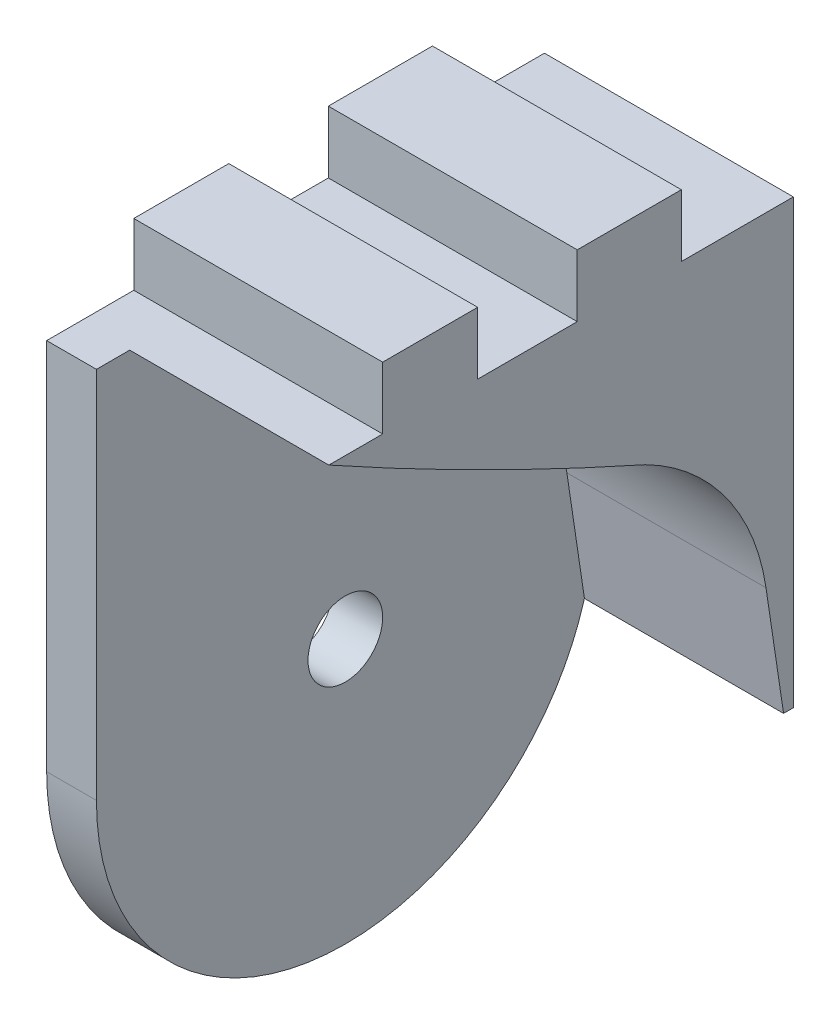
ISO-10303-21;
HEADER;
FILE_DESCRIPTION(('STEP AP214'),'2;1');
FILE_NAME('part.step','',(''),(''),'','','');
FILE_SCHEMA(('AUTOMOTIVE_DESIGN { 1 0 10303 214 1 1 1 1 }'));
ENDSEC;
DATA;
#1=APPLICATION_CONTEXT('core data for automotive mechanical design processes');
#2=APPLICATION_PROTOCOL_DEFINITION('international standard','automotive_design',2000,#1);
#3=PRODUCT_CONTEXT('',#1,'mechanical');
#4=PRODUCT('Part','Part','',(#3));
#5=PRODUCT_RELATED_PRODUCT_CATEGORY('part','',(#4));
#6=PRODUCT_DEFINITION_FORMATION('','',#4);
#7=PRODUCT_DEFINITION_CONTEXT('part definition',#1,'design');
#8=PRODUCT_DEFINITION('design','',#6,#7);
#9=PRODUCT_DEFINITION_SHAPE('','',#8);
#10=(LENGTH_UNIT() NAMED_UNIT(*) SI_UNIT(.MILLI.,.METRE.));
#11=(NAMED_UNIT(*) PLANE_ANGLE_UNIT() SI_UNIT($,.RADIAN.));
#12=(NAMED_UNIT(*) SI_UNIT($,.STERADIAN.) SOLID_ANGLE_UNIT());
#13=UNCERTAINTY_MEASURE_WITH_UNIT(LENGTH_MEASURE(1.E-05),#10,'distance_accuracy_value','');
#14=(GEOMETRIC_REPRESENTATION_CONTEXT(3) GLOBAL_UNCERTAINTY_ASSIGNED_CONTEXT((#13)) GLOBAL_UNIT_ASSIGNED_CONTEXT((#10,
#11,#12)) REPRESENTATION_CONTEXT('',''));
#15=CARTESIAN_POINT('',(0.,0.,0.));
#16=DIRECTION('',(0.,0.,1.));
#17=DIRECTION('',(1.,0.,0.));
#18=AXIS2_PLACEMENT_3D('',#15,#16,#17);
#19=CARTESIAN_POINT('',(-4.,55.,40.));
#20=DIRECTION('',(0.,-1.,0.));
#21=DIRECTION('',(1.,0.,0.));
#22=AXIS2_PLACEMENT_3D('',#19,#20,#21);
#23=PLANE('',#22);
#24=DIRECTION('',(0.,0.,-1.));
#25=VECTOR('',#24,1.);
#26=CARTESIAN_POINT('',(-4.,55.,40.));
#27=LINE('',#26,#25);
#28=CARTESIAN_POINT('',(-4.,55.,33.));
#29=VERTEX_POINT('',#28);
#30=CARTESIAN_POINT('',(-4.,55.,25.3660375931076));
#31=VERTEX_POINT('',#30);
#32=EDGE_CURVE('E282',#29,#31,#27,.T.);
#33=ORIENTED_EDGE('',*,*,#32,.F.);
#34=DIRECTION('',(-1.,0.,0.));
#35=VECTOR('',#34,1.);
#36=CARTESIAN_POINT('',(16.,55.,33.));
#37=LINE('',#36,#35);
#38=CARTESIAN_POINT('',(16.,55.,33.));
#39=VERTEX_POINT('',#38);
#40=EDGE_CURVE('E219',#39,#29,#37,.T.);
#41=ORIENTED_EDGE('',*,*,#40,.F.);
#42=DIRECTION('',(0.,0.,-1.));
#43=VECTOR('',#42,1.);
#44=CARTESIAN_POINT('',(16.,55.,40.));
#45=LINE('',#44,#43);
#46=CARTESIAN_POINT('',(16.,55.,25.3660375931076));
#47=VERTEX_POINT('',#46);
#48=EDGE_CURVE('E285',#39,#47,#45,.T.);
#49=ORIENTED_EDGE('',*,*,#48,.T.);
#50=DIRECTION('',(-1.,0.,0.));
#51=VECTOR('',#50,1.);
#52=CARTESIAN_POINT('',(16.,55.,25.3660375931076));
#53=LINE('',#52,#51);
#54=EDGE_CURVE('E221',#47,#31,#53,.T.);
#55=ORIENTED_EDGE('',*,*,#54,.T.);
#56=EDGE_LOOP('',(#33,#41,#49,#55));
#57=FACE_BOUND('',#56,.T.);
#58=ADVANCED_FACE('F38',(#57),#23,.F.);
#59=CARTESIAN_POINT('',(0.,0.,40.));
#60=DIRECTION('',(-1.,0.,0.));
#61=DIRECTION('',(0.,0.,1.));
#62=AXIS2_PLACEMENT_3D('',#59,#60,#61);
#63=PLANE('',#62);
#64=CARTESIAN_POINT('',(0.,21.2375980792143,20.));
#65=DIRECTION('',(-1.,0.,0.));
#66=DIRECTION('',(0.,0.,1.));
#67=AXIS2_PLACEMENT_3D('',#64,#65,#66);
#68=CIRCLE('',#67,3.);
#69=CARTESIAN_POINT('',(0.,21.2375980792143,23.));
#70=VERTEX_POINT('',#69);
#71=EDGE_CURVE('E236',#70,#70,#68,.T.);
#72=ORIENTED_EDGE('',*,*,#71,.T.);
#73=EDGE_LOOP('',(#72));
#74=FACE_BOUND('',#73,.T.);
#75=CARTESIAN_POINT('',(0.,335.816317486461,-121.193092553436));
#76=DIRECTION('',(-1.,0.,0.));
#77=DIRECTION('',(0.,0.,1.));
#78=AXIS2_PLACEMENT_3D('',#75,#76,#77);
#79=CIRCLE('',#78,326.831732663771);
#80=CARTESIAN_POINT('',(0.,50.,37.3250897931997));
#81=VERTEX_POINT('',#80);
#82=CARTESIAN_POINT('',(0.,37.3056268301771,11.8871427931811));
#83=VERTEX_POINT('',#82);
#84=EDGE_CURVE('E266',#81,#83,#79,.F.);
#85=ORIENTED_EDGE('',*,*,#84,.F.);
#86=DIRECTION('',(0.,0.,1.));
#87=VECTOR('',#86,1.);
#88=CARTESIAN_POINT('',(0.,50.,40.0000000000001));
#89=LINE('',#88,#87);
#90=CARTESIAN_POINT('',(0.,50.,40.));
#91=VERTEX_POINT('',#90);
#92=EDGE_CURVE('E216',#81,#91,#89,.T.);
#93=ORIENTED_EDGE('',*,*,#92,.T.);
#94=DIRECTION('',(0.,1.,0.));
#95=VECTOR('',#94,1.);
#96=CARTESIAN_POINT('',(0.,0.,40.));
#97=LINE('',#96,#95);
#98=CARTESIAN_POINT('',(0.,20.,40.));
#99=VERTEX_POINT('',#98);
#100=EDGE_CURVE('E271',#99,#91,#97,.T.);
#101=ORIENTED_EDGE('',*,*,#100,.F.);
#102=CARTESIAN_POINT('',(0.,20.,20.));
#103=DIRECTION('',(-1.,0.,0.));
#104=DIRECTION('',(0.,0.,1.));
#105=AXIS2_PLACEMENT_3D('',#102,#103,#104);
#106=CIRCLE('',#105,20.);
#107=CARTESIAN_POINT('',(0.,0.,20.));
#108=VERTEX_POINT('',#107);
#109=EDGE_CURVE('E286',#99,#108,#106,.F.);
#110=ORIENTED_EDGE('',*,*,#109,.T.);
#111=CARTESIAN_POINT('',(0.,20.,20.));
#112=DIRECTION('',(-1.,0.,0.));
#113=DIRECTION('',(0.,0.,1.));
#114=AXIS2_PLACEMENT_3D('',#111,#112,#113);
#115=CIRCLE('',#114,20.);
#116=CARTESIAN_POINT('',(0.,14.4473036085163,0.786266297671242));
#117=VERTEX_POINT('',#116);
#118=EDGE_CURVE('E288',#108,#117,#115,.F.);
#119=ORIENTED_EDGE('',*,*,#118,.T.);
#120=DIRECTION('',(0.,0.989031049423699,0.147707763085953));
#121=VECTOR('',#120,1.);
#122=CARTESIAN_POINT('',(0.,6.04384407887813,-0.468756191288486));
#123=LINE('',#122,#121);
#124=CARTESIAN_POINT('',(0.,23.8963378147614,2.19744111037341));
#125=VERTEX_POINT('',#124);
#126=EDGE_CURVE('E255',#117,#125,#123,.T.);
#127=ORIENTED_EDGE('',*,*,#126,.T.);
#128=CARTESIAN_POINT('',(0.,21.2375980792143,20.));
#129=DIRECTION('',(-1.,0.,0.));
#130=DIRECTION('',(0.,0.,1.));
#131=AXIS2_PLACEMENT_3D('',#128,#129,#130);
#132=CIRCLE('',#131,18.);
#133=EDGE_CURVE('E268',#83,#125,#132,.T.);
#134=ORIENTED_EDGE('',*,*,#133,.F.);
#135=EDGE_LOOP('',(#85,#93,#101,#110,#119,#127,#134));
#136=FACE_BOUND('',#135,.T.);
#137=ADVANCED_FACE('F322',(#74,#136),#63,.F.);
#138=CARTESIAN_POINT('',(16.,55.,40.));
#139=DIRECTION('',(-1.,0.,0.));
#140=DIRECTION('',(0.,0.,1.));
#141=AXIS2_PLACEMENT_3D('',#138,#139,#140);
#142=PLANE('',#141);
#143=DIRECTION('',(0.,-1.,0.));
#144=VECTOR('',#143,1.);
#145=CARTESIAN_POINT('',(16.,55.,33.));
#146=LINE('',#145,#144);
#147=CARTESIAN_POINT('',(16.,50.,33.));
#148=VERTEX_POINT('',#147);
#149=EDGE_CURVE('E196',#39,#148,#146,.T.);
#150=ORIENTED_EDGE('',*,*,#149,.T.);
#151=DIRECTION('',(0.,0.,1.));
#152=VECTOR('',#151,1.);
#153=CARTESIAN_POINT('',(16.,50.,33.));
#154=LINE('',#153,#152);
#155=CARTESIAN_POINT('',(16.,50.0000000000002,37.3250897931997));
#156=VERTEX_POINT('',#155);
#157=EDGE_CURVE('E198',#148,#156,#154,.T.);
#158=ORIENTED_EDGE('',*,*,#157,.T.);
#159=CARTESIAN_POINT('',(16.,335.816317486461,-121.193092553436));
#160=DIRECTION('',(-1.,0.,0.));
#161=DIRECTION('',(0.,0.,1.));
#162=AXIS2_PLACEMENT_3D('',#159,#160,#161);
#163=CIRCLE('',#162,326.831732663771);
#164=CARTESIAN_POINT('',(16.,37.3056268301771,11.8871427931811));
#165=VERTEX_POINT('',#164);
#166=EDGE_CURVE('E248',#156,#165,#163,.F.);
#167=ORIENTED_EDGE('',*,*,#166,.T.);
#168=CARTESIAN_POINT('',(16.,21.2375980792143,20.));
#169=DIRECTION('',(-1.,0.,0.));
#170=DIRECTION('',(0.,0.,1.));
#171=AXIS2_PLACEMENT_3D('',#168,#169,#170);
#172=CIRCLE('',#171,18.);
#173=CARTESIAN_POINT('',(16.,23.8963378147614,2.19744111037341));
#174=VERTEX_POINT('',#173);
#175=EDGE_CURVE('E246',#165,#174,#172,.T.);
#176=ORIENTED_EDGE('',*,*,#175,.T.);
#177=DIRECTION('',(0.,0.989031049423699,0.147707763085953));
#178=VECTOR('',#177,1.);
#179=CARTESIAN_POINT('',(16.,0.200341521561027,-1.34145952232274));
#180=LINE('',#179,#178);
#181=CARTESIAN_POINT('',(16.,14.4473036085163,0.786266297671242));
#182=VERTEX_POINT('',#181);
#183=EDGE_CURVE('E243',#182,#174,#180,.T.);
#184=ORIENTED_EDGE('',*,*,#183,.F.);
#185=DIRECTION('',(0.,0.,1.));
#186=VECTOR('',#185,1.);
#187=CARTESIAN_POINT('',(16.,14.4473036085163,0.));
#188=LINE('',#187,#186);
#189=CARTESIAN_POINT('',(16.,14.4473036085163,0.));
#190=VERTEX_POINT('',#189);
#191=EDGE_CURVE('E240',#190,#182,#188,.T.);
#192=ORIENTED_EDGE('',*,*,#191,.F.);
#193=DIRECTION('',(0.,1.,0.));
#194=VECTOR('',#193,1.);
#195=CARTESIAN_POINT('',(16.,55.,0.));
#196=LINE('',#195,#194);
#197=CARTESIAN_POINT('',(16.,50.,0.));
#198=VERTEX_POINT('',#197);
#199=EDGE_CURVE('E182',#190,#198,#196,.T.);
#200=ORIENTED_EDGE('',*,*,#199,.T.);
#201=DIRECTION('',(0.,0.,1.));
#202=VECTOR('',#201,1.);
#203=CARTESIAN_POINT('',(16.,50.,0.));
#204=LINE('',#203,#202);
#205=CARTESIAN_POINT('',(16.,50.,9.00000000000001));
#206=VERTEX_POINT('',#205);
#207=EDGE_CURVE('E61',#198,#206,#204,.T.);
#208=ORIENTED_EDGE('',*,*,#207,.T.);
#209=DIRECTION('',(0.,1.,0.));
#210=VECTOR('',#209,1.);
#211=CARTESIAN_POINT('',(16.,50.,9.00000000000001));
#212=LINE('',#211,#210);
#213=CARTESIAN_POINT('',(16.,55.,9.));
#214=VERTEX_POINT('',#213);
#215=EDGE_CURVE('E170',#206,#214,#212,.T.);
#216=ORIENTED_EDGE('',*,*,#215,.T.);
#217=CARTESIAN_POINT('',(16.,55.,17.3660375931076));
#218=VERTEX_POINT('',#217);
#219=EDGE_CURVE('E283',#218,#214,#45,.T.);
#220=ORIENTED_EDGE('',*,*,#219,.F.);
#221=DIRECTION('',(0.,-1.,0.));
#222=VECTOR('',#221,1.);
#223=CARTESIAN_POINT('',(16.,55.,17.3660375931076));
#224=LINE('',#223,#222);
#225=CARTESIAN_POINT('',(16.,50.,17.3660375931076));
#226=VERTEX_POINT('',#225);
#227=EDGE_CURVE('E176',#218,#226,#224,.T.);
#228=ORIENTED_EDGE('',*,*,#227,.T.);
#229=DIRECTION('',(0.,0.,1.));
#230=VECTOR('',#229,1.);
#231=CARTESIAN_POINT('',(16.,50.,17.3660375931076));
#232=LINE('',#231,#230);
#233=CARTESIAN_POINT('',(16.,50.,25.3660375931076));
#234=VERTEX_POINT('',#233);
#235=EDGE_CURVE('E190',#226,#234,#232,.T.);
#236=ORIENTED_EDGE('',*,*,#235,.T.);
#237=DIRECTION('',(0.,1.,0.));
#238=VECTOR('',#237,1.);
#239=CARTESIAN_POINT('',(16.,50.,25.3660375931076));
#240=LINE('',#239,#238);
#241=EDGE_CURVE('E193',#234,#47,#240,.T.);
#242=ORIENTED_EDGE('',*,*,#241,.T.);
#243=ORIENTED_EDGE('',*,*,#48,.F.);
#244=EDGE_LOOP('',(#150,#158,#167,#176,#184,#192,#200,#208,#216,#220,#228,#236,#242,#243));
#245=FACE_BOUND('',#244,.T.);
#246=ADVANCED_FACE('F180',(#245),#142,.F.);
#247=CARTESIAN_POINT('',(-4.,55.,17.3660375931076));
#248=VERTEX_POINT('',#247);
#249=CARTESIAN_POINT('',(-4.,55.,9.));
#250=VERTEX_POINT('',#249);
#251=EDGE_CURVE('E277',#248,#250,#27,.T.);
#252=ORIENTED_EDGE('',*,*,#251,.F.);
#253=DIRECTION('',(-1.,0.,0.));
#254=VECTOR('',#253,1.);
#255=CARTESIAN_POINT('',(16.,55.,17.3660375931076));
#256=LINE('',#255,#254);
#257=EDGE_CURVE('E53',#218,#248,#256,.T.);
#258=ORIENTED_EDGE('',*,*,#257,.F.);
#259=ORIENTED_EDGE('',*,*,#219,.T.);
#260=DIRECTION('',(-1.,0.,0.));
#261=VECTOR('',#260,1.);
#262=CARTESIAN_POINT('',(16.,55.,9.));
#263=LINE('',#262,#261);
#264=EDGE_CURVE('E166',#214,#250,#263,.T.);
#265=ORIENTED_EDGE('',*,*,#264,.T.);
#266=EDGE_LOOP('',(#252,#258,#259,#265));
#267=FACE_BOUND('',#266,.T.);
#268=ADVANCED_FACE('F354',(#267),#23,.F.);
#269=CARTESIAN_POINT('',(-4.,0.,40.));
#270=DIRECTION('',(1.,0.,0.));
#271=DIRECTION('',(0.,0.,-1.));
#272=AXIS2_PLACEMENT_3D('',#269,#270,#271);
#273=PLANE('',#272);
#274=CARTESIAN_POINT('',(-4.,21.2375980792143,20.));
#275=DIRECTION('',(-1.,0.,0.));
#276=DIRECTION('',(0.,0.,1.));
#277=AXIS2_PLACEMENT_3D('',#274,#275,#276);
#278=CIRCLE('',#277,3.);
#279=CARTESIAN_POINT('',(-4.,21.2375980792143,23.));
#280=VERTEX_POINT('',#279);
#281=EDGE_CURVE('E233',#280,#280,#278,.T.);
#282=ORIENTED_EDGE('',*,*,#281,.F.);
#283=EDGE_LOOP('',(#282));
#284=FACE_BOUND('',#283,.T.);
#285=DIRECTION('',(0.,-1.,0.));
#286=VECTOR('',#285,1.);
#287=CARTESIAN_POINT('',(-4.,0.,40.));
#288=LINE('',#287,#286);
#289=CARTESIAN_POINT('',(-4.,50.,40.));
#290=VERTEX_POINT('',#289);
#291=CARTESIAN_POINT('',(-4.,20.,40.));
#292=VERTEX_POINT('',#291);
#293=EDGE_CURVE('E274',#290,#292,#288,.T.);
#294=ORIENTED_EDGE('',*,*,#293,.F.);
#295=DIRECTION('',(0.,0.,1.));
#296=VECTOR('',#295,1.);
#297=CARTESIAN_POINT('',(-4.,50.,33.));
#298=LINE('',#297,#296);
#299=CARTESIAN_POINT('',(-4.,50.,33.));
#300=VERTEX_POINT('',#299);
#301=EDGE_CURVE('E183',#300,#290,#298,.T.);
#302=ORIENTED_EDGE('',*,*,#301,.F.);
#303=DIRECTION('',(0.,-1.,0.));
#304=VECTOR('',#303,1.);
#305=CARTESIAN_POINT('',(-4.,55.,33.));
#306=LINE('',#305,#304);
#307=EDGE_CURVE('E185',#29,#300,#306,.T.);
#308=ORIENTED_EDGE('',*,*,#307,.F.);
#309=ORIENTED_EDGE('',*,*,#32,.T.);
#310=DIRECTION('',(0.,1.,0.));
#311=VECTOR('',#310,1.);
#312=CARTESIAN_POINT('',(-4.,50.,25.3660375931076));
#313=LINE('',#312,#311);
#314=CARTESIAN_POINT('',(-4.,50.,25.3660375931076));
#315=VERTEX_POINT('',#314);
#316=EDGE_CURVE('E209',#315,#31,#313,.T.);
#317=ORIENTED_EDGE('',*,*,#316,.F.);
#318=DIRECTION('',(0.,0.,1.));
#319=VECTOR('',#318,1.);
#320=CARTESIAN_POINT('',(-4.,50.,17.3660375931076));
#321=LINE('',#320,#319);
#322=CARTESIAN_POINT('',(-4.,50.,17.3660375931076));
#323=VERTEX_POINT('',#322);
#324=EDGE_CURVE('E206',#323,#315,#321,.T.);
#325=ORIENTED_EDGE('',*,*,#324,.F.);
#326=DIRECTION('',(0.,-1.,0.));
#327=VECTOR('',#326,1.);
#328=CARTESIAN_POINT('',(-4.,55.,17.3660375931076));
#329=LINE('',#328,#327);
#330=EDGE_CURVE('E204',#248,#323,#329,.T.);
#331=ORIENTED_EDGE('',*,*,#330,.F.);
#332=ORIENTED_EDGE('',*,*,#251,.T.);
#333=DIRECTION('',(0.,1.,0.));
#334=VECTOR('',#333,1.);
#335=CARTESIAN_POINT('',(-4.,50.,9.00000000000001));
#336=LINE('',#335,#334);
#337=CARTESIAN_POINT('',(-4.,50.,9.00000000000001));
#338=VERTEX_POINT('',#337);
#339=EDGE_CURVE('E202',#338,#250,#336,.T.);
#340=ORIENTED_EDGE('',*,*,#339,.F.);
#341=DIRECTION('',(0.,0.,1.));
#342=VECTOR('',#341,1.);
#343=CARTESIAN_POINT('',(-4.,50.,0.));
#344=LINE('',#343,#342);
#345=CARTESIAN_POINT('',(-4.,50.,0.));
#346=VERTEX_POINT('',#345);
#347=EDGE_CURVE('E163',#346,#338,#344,.T.);
#348=ORIENTED_EDGE('',*,*,#347,.F.);
#349=DIRECTION('',(0.,-1.,0.));
#350=VECTOR('',#349,1.);
#351=CARTESIAN_POINT('',(-4.,0.,0.));
#352=LINE('',#351,#350);
#353=CARTESIAN_POINT('',(-4.,14.4473036085163,0.));
#354=VERTEX_POINT('',#353);
#355=EDGE_CURVE('E275',#346,#354,#352,.T.);
#356=ORIENTED_EDGE('',*,*,#355,.T.);
#357=DIRECTION('',(0.,0.,1.));
#358=VECTOR('',#357,1.);
#359=CARTESIAN_POINT('',(-4.,14.4473036085163,0.));
#360=LINE('',#359,#358);
#361=CARTESIAN_POINT('',(-4.,14.4473036085163,0.786266297671243));
#362=VERTEX_POINT('',#361);
#363=EDGE_CURVE('E239',#354,#362,#360,.T.);
#364=ORIENTED_EDGE('',*,*,#363,.T.);
#365=CARTESIAN_POINT('',(-4.,20.,20.));
#366=DIRECTION('',(1.,0.,0.));
#367=DIRECTION('',(0.,0.,-1.));
#368=AXIS2_PLACEMENT_3D('',#365,#366,#367);
#369=CIRCLE('',#368,20.);
#370=CARTESIAN_POINT('',(-4.,0.,20.));
#371=VERTEX_POINT('',#370);
#372=EDGE_CURVE('E294',#362,#371,#369,.F.);
#373=ORIENTED_EDGE('',*,*,#372,.T.);
#374=CARTESIAN_POINT('',(-4.,20.,20.));
#375=DIRECTION('',(1.,0.,0.));
#376=DIRECTION('',(0.,0.,-1.));
#377=AXIS2_PLACEMENT_3D('',#374,#375,#376);
#378=CIRCLE('',#377,20.);
#379=EDGE_CURVE('E291',#371,#292,#378,.F.);
#380=ORIENTED_EDGE('',*,*,#379,.T.);
#381=EDGE_LOOP('',(#294,#302,#308,#309,#317,#325,#331,#332,#340,#348,#356,#364,#373,#380));
#382=FACE_BOUND('',#381,.T.);
#383=ADVANCED_FACE('F313',(#284,#382),#273,.F.);
#384=CARTESIAN_POINT('',(0.,0.,40.));
#385=DIRECTION('',(0.,0.,-1.));
#386=DIRECTION('',(-1.,0.,0.));
#387=AXIS2_PLACEMENT_3D('',#384,#385,#386);
#388=PLANE('',#387);
#389=ORIENTED_EDGE('',*,*,#100,.T.);
#390=DIRECTION('',(-1.,0.,0.));
#391=VECTOR('',#390,1.);
#392=CARTESIAN_POINT('',(16.,50.,40.));
#393=LINE('',#392,#391);
#394=EDGE_CURVE('E213',#91,#290,#393,.T.);
#395=ORIENTED_EDGE('',*,*,#394,.T.);
#396=ORIENTED_EDGE('',*,*,#293,.T.);
#397=DIRECTION('',(1.,0.,0.));
#398=VECTOR('',#397,1.);
#399=CARTESIAN_POINT('',(0.,20.,40.));
#400=LINE('',#399,#398);
#401=EDGE_CURVE('E296',#292,#99,#400,.T.);
#402=ORIENTED_EDGE('',*,*,#401,.T.);
#403=EDGE_LOOP('',(#389,#395,#396,#402));
#404=FACE_BOUND('',#403,.T.);
#405=ADVANCED_FACE('F319',(#404),#388,.F.);
#406=CARTESIAN_POINT('',(0.,0.,0.));
#407=DIRECTION('',(0.,0.,-1.));
#408=DIRECTION('',(-1.,0.,0.));
#409=AXIS2_PLACEMENT_3D('',#406,#407,#408);
#410=PLANE('',#409);
#411=DIRECTION('',(-1.,0.,0.));
#412=VECTOR('',#411,1.);
#413=CARTESIAN_POINT('',(16.,50.,0.));
#414=LINE('',#413,#412);
#415=EDGE_CURVE('E167',#198,#346,#414,.T.);
#416=ORIENTED_EDGE('',*,*,#415,.F.);
#417=ORIENTED_EDGE('',*,*,#199,.F.);
#418=DIRECTION('',(-1.,0.,0.));
#419=VECTOR('',#418,1.);
#420=CARTESIAN_POINT('',(16.,14.4473036085163,0.));
#421=LINE('',#420,#419);
#422=EDGE_CURVE('E250',#190,#354,#421,.T.);
#423=ORIENTED_EDGE('',*,*,#422,.T.);
#424=ORIENTED_EDGE('',*,*,#355,.F.);
#425=EDGE_LOOP('',(#416,#417,#423,#424));
#426=FACE_BOUND('',#425,.T.);
#427=ADVANCED_FACE('F380',(#426),#410,.T.);
#428=CARTESIAN_POINT('',(0.,20.,20.));
#429=DIRECTION('',(1.,0.,0.));
#430=DIRECTION('',(0.,1.,0.));
#431=AXIS2_PLACEMENT_3D('',#428,#429,#430);
#432=CYLINDRICAL_SURFACE('',#431,20.);
#433=ORIENTED_EDGE('',*,*,#401,.F.);
#434=ORIENTED_EDGE('',*,*,#379,.F.);
#435=DIRECTION('',(1.,0.,0.));
#436=VECTOR('',#435,1.);
#437=CARTESIAN_POINT('',(0.,0.,20.));
#438=LINE('',#437,#436);
#439=EDGE_CURVE('E270',#108,#371,#438,.F.);
#440=ORIENTED_EDGE('',*,*,#439,.F.);
#441=ORIENTED_EDGE('',*,*,#109,.F.);
#442=EDGE_LOOP('',(#433,#434,#440,#441));
#443=FACE_BOUND('',#442,.T.);
#444=ADVANCED_FACE('F40',(#443),#432,.T.);
#445=CARTESIAN_POINT('',(0.,20.,20.));
#446=DIRECTION('',(-1.,0.,0.));
#447=DIRECTION('',(0.,-1.,0.));
#448=AXIS2_PLACEMENT_3D('',#445,#446,#447);
#449=CYLINDRICAL_SURFACE('',#448,20.);
#450=DIRECTION('',(-1.,0.,0.));
#451=VECTOR('',#450,1.);
#452=CARTESIAN_POINT('',(0.,14.4473036085163,0.786266297671246));
#453=LINE('',#452,#451);
#454=EDGE_CURVE('E46',#117,#362,#453,.T.);
#455=ORIENTED_EDGE('',*,*,#454,.F.);
#456=ORIENTED_EDGE('',*,*,#118,.F.);
#457=ORIENTED_EDGE('',*,*,#439,.T.);
#458=ORIENTED_EDGE('',*,*,#372,.F.);
#459=EDGE_LOOP('',(#455,#456,#457,#458));
#460=FACE_BOUND('',#459,.T.);
#461=ADVANCED_FACE('F308',(#460),#449,.T.);
#462=CARTESIAN_POINT('',(16.,21.2375980792143,20.));
#463=DIRECTION('',(-1.,0.,0.));
#464=DIRECTION('',(0.,0.,1.));
#465=AXIS2_PLACEMENT_3D('',#462,#463,#464);
#466=CYLINDRICAL_SURFACE('',#465,18.);
#467=DIRECTION('',(-1.,0.,0.));
#468=VECTOR('',#467,1.);
#469=CARTESIAN_POINT('',(16.,37.3056268301771,11.8871427931811));
#470=LINE('',#469,#468);
#471=EDGE_CURVE('E252',#165,#83,#470,.T.);
#472=ORIENTED_EDGE('',*,*,#471,.T.);
#473=ORIENTED_EDGE('',*,*,#133,.T.);
#474=DIRECTION('',(-1.,0.,0.));
#475=VECTOR('',#474,1.);
#476=CARTESIAN_POINT('',(16.,23.8963378147614,2.19744111037341));
#477=LINE('',#476,#475);
#478=EDGE_CURVE('E256',#174,#125,#477,.T.);
#479=ORIENTED_EDGE('',*,*,#478,.F.);
#480=ORIENTED_EDGE('',*,*,#175,.F.);
#481=EDGE_LOOP('',(#472,#473,#479,#480));
#482=FACE_BOUND('',#481,.T.);
#483=ADVANCED_FACE('F373',(#482),#466,.F.);
#484=CARTESIAN_POINT('',(16.,335.816317486461,-121.193092553436));
#485=DIRECTION('',(-1.,0.,0.));
#486=DIRECTION('',(0.,0.,1.));
#487=AXIS2_PLACEMENT_3D('',#484,#485,#486);
#488=CYLINDRICAL_SURFACE('',#487,326.831732663771);
#489=ORIENTED_EDGE('',*,*,#166,.F.);
#490=DIRECTION('',(-1.,0.,0.));
#491=VECTOR('',#490,1.);
#492=CARTESIAN_POINT('',(16.,50.0000000000001,37.3250897931997));
#493=LINE('',#492,#491);
#494=EDGE_CURVE('E11',#156,#81,#493,.T.);
#495=ORIENTED_EDGE('',*,*,#494,.T.);
#496=ORIENTED_EDGE('',*,*,#84,.T.);
#497=ORIENTED_EDGE('',*,*,#471,.F.);
#498=EDGE_LOOP('',(#489,#495,#496,#497));
#499=FACE_BOUND('',#498,.T.);
#500=ADVANCED_FACE('F329',(#499),#488,.T.);
#501=CARTESIAN_POINT('',(16.,0.200341521561027,-1.34145952232274));
#502=DIRECTION('',(0.,-0.147707763085953,0.989031049423699));
#503=DIRECTION('',(0.,-0.989031049423699,-0.147707763085953));
#504=AXIS2_PLACEMENT_3D('',#501,#502,#503);
#505=PLANE('',#504);
#506=ORIENTED_EDGE('',*,*,#126,.F.);
#507=DIRECTION('',(-1.,0.,0.));
#508=VECTOR('',#507,1.);
#509=CARTESIAN_POINT('',(16.,14.4473036085163,0.786266297671242));
#510=LINE('',#509,#508);
#511=EDGE_CURVE('E259',#182,#117,#510,.T.);
#512=ORIENTED_EDGE('',*,*,#511,.F.);
#513=ORIENTED_EDGE('',*,*,#183,.T.);
#514=ORIENTED_EDGE('',*,*,#478,.T.);
#515=EDGE_LOOP('',(#506,#512,#513,#514));
#516=FACE_BOUND('',#515,.T.);
#517=ADVANCED_FACE('F394',(#516),#505,.T.);
#518=CARTESIAN_POINT('',(16.,14.4473036085163,0.));
#519=DIRECTION('',(0.,-1.,0.));
#520=DIRECTION('',(0.,0.,-1.));
#521=AXIS2_PLACEMENT_3D('',#518,#519,#520);
#522=PLANE('',#521);
#523=ORIENTED_EDGE('',*,*,#363,.F.);
#524=ORIENTED_EDGE('',*,*,#422,.F.);
#525=ORIENTED_EDGE('',*,*,#191,.T.);
#526=ORIENTED_EDGE('',*,*,#511,.T.);
#527=ORIENTED_EDGE('',*,*,#454,.T.);
#528=EDGE_LOOP('',(#523,#524,#525,#526,#527));
#529=FACE_BOUND('',#528,.T.);
#530=ADVANCED_FACE('F304',(#529),#522,.T.);
#531=CARTESIAN_POINT('',(6.,21.2375980792143,20.));
#532=DIRECTION('',(-1.,0.,0.));
#533=DIRECTION('',(0.,0.,1.));
#534=AXIS2_PLACEMENT_3D('',#531,#532,#533);
#535=CYLINDRICAL_SURFACE('',#534,3.);
#536=ORIENTED_EDGE('',*,*,#281,.T.);
#537=EDGE_LOOP('',(#536));
#538=FACE_BOUND('',#537,.T.);
#539=ORIENTED_EDGE('',*,*,#71,.F.);
#540=EDGE_LOOP('',(#539));
#541=FACE_BOUND('',#540,.T.);
#542=ADVANCED_FACE('F393',(#538,#541),#535,.F.);
#543=CARTESIAN_POINT('',(16.,50.,33.));
#544=DIRECTION('',(0.,-1.,0.));
#545=DIRECTION('',(0.,0.,-1.));
#546=AXIS2_PLACEMENT_3D('',#543,#544,#545);
#547=PLANE('',#546);
#548=ORIENTED_EDGE('',*,*,#494,.F.);
#549=ORIENTED_EDGE('',*,*,#157,.F.);
#550=DIRECTION('',(-1.,0.,0.));
#551=VECTOR('',#550,1.);
#552=CARTESIAN_POINT('',(16.,50.,33.));
#553=LINE('',#552,#551);
#554=EDGE_CURVE('E217',#148,#300,#553,.T.);
#555=ORIENTED_EDGE('',*,*,#554,.T.);
#556=ORIENTED_EDGE('',*,*,#301,.T.);
#557=ORIENTED_EDGE('',*,*,#394,.F.);
#558=ORIENTED_EDGE('',*,*,#92,.F.);
#559=EDGE_LOOP('',(#548,#549,#555,#556,#557,#558));
#560=FACE_BOUND('',#559,.T.);
#561=ADVANCED_FACE('F325',(#560),#547,.F.);
#562=CARTESIAN_POINT('',(16.,55.,33.));
#563=DIRECTION('',(0.,0.,-1.));
#564=DIRECTION('',(-1.,0.,0.));
#565=AXIS2_PLACEMENT_3D('',#562,#563,#564);
#566=PLANE('',#565);
#567=ORIENTED_EDGE('',*,*,#307,.T.);
#568=ORIENTED_EDGE('',*,*,#554,.F.);
#569=ORIENTED_EDGE('',*,*,#149,.F.);
#570=ORIENTED_EDGE('',*,*,#40,.T.);
#571=EDGE_LOOP('',(#567,#568,#569,#570));
#572=FACE_BOUND('',#571,.T.);
#573=ADVANCED_FACE('F338',(#572),#566,.F.);
#574=CARTESIAN_POINT('',(16.,50.,0.));
#575=DIRECTION('',(0.,-1.,0.));
#576=DIRECTION('',(0.,0.,-1.));
#577=AXIS2_PLACEMENT_3D('',#574,#575,#576);
#578=PLANE('',#577);
#579=ORIENTED_EDGE('',*,*,#347,.T.);
#580=DIRECTION('',(-1.,0.,0.));
#581=VECTOR('',#580,1.);
#582=CARTESIAN_POINT('',(16.,50.,9.00000000000001));
#583=LINE('',#582,#581);
#584=EDGE_CURVE('E159',#206,#338,#583,.T.);
#585=ORIENTED_EDGE('',*,*,#584,.F.);
#586=ORIENTED_EDGE('',*,*,#207,.F.);
#587=ORIENTED_EDGE('',*,*,#415,.T.);
#588=EDGE_LOOP('',(#579,#585,#586,#587));
#589=FACE_BOUND('',#588,.T.);
#590=ADVANCED_FACE('F161',(#589),#578,.F.);
#591=CARTESIAN_POINT('',(16.,50.,9.00000000000001));
#592=DIRECTION('',(0.,0.,1.));
#593=DIRECTION('',(0.,-1.,0.));
#594=AXIS2_PLACEMENT_3D('',#591,#592,#593);
#595=PLANE('',#594);
#596=ORIENTED_EDGE('',*,*,#339,.T.);
#597=ORIENTED_EDGE('',*,*,#264,.F.);
#598=ORIENTED_EDGE('',*,*,#215,.F.);
#599=ORIENTED_EDGE('',*,*,#584,.T.);
#600=EDGE_LOOP('',(#596,#597,#598,#599));
#601=FACE_BOUND('',#600,.T.);
#602=ADVANCED_FACE('F171',(#601),#595,.F.);
#603=CARTESIAN_POINT('',(16.,50.,25.3660375931076));
#604=DIRECTION('',(0.,0.,1.));
#605=DIRECTION('',(1.,0.,0.));
#606=AXIS2_PLACEMENT_3D('',#603,#604,#605);
#607=PLANE('',#606);
#608=ORIENTED_EDGE('',*,*,#316,.T.);
#609=ORIENTED_EDGE('',*,*,#54,.F.);
#610=ORIENTED_EDGE('',*,*,#241,.F.);
#611=DIRECTION('',(-1.,0.,0.));
#612=VECTOR('',#611,1.);
#613=CARTESIAN_POINT('',(16.,50.,25.3660375931076));
#614=LINE('',#613,#612);
#615=EDGE_CURVE('E224',#234,#315,#614,.T.);
#616=ORIENTED_EDGE('',*,*,#615,.T.);
#617=EDGE_LOOP('',(#608,#609,#610,#616));
#618=FACE_BOUND('',#617,.T.);
#619=ADVANCED_FACE('F347',(#618),#607,.F.);
#620=CARTESIAN_POINT('',(16.,50.,17.3660375931076));
#621=DIRECTION('',(0.,-1.,0.));
#622=DIRECTION('',(0.,0.,-1.));
#623=AXIS2_PLACEMENT_3D('',#620,#621,#622);
#624=PLANE('',#623);
#625=ORIENTED_EDGE('',*,*,#324,.T.);
#626=ORIENTED_EDGE('',*,*,#615,.F.);
#627=ORIENTED_EDGE('',*,*,#235,.F.);
#628=DIRECTION('',(-1.,0.,0.));
#629=VECTOR('',#628,1.);
#630=CARTESIAN_POINT('',(16.,50.,17.3660375931076));
#631=LINE('',#630,#629);
#632=EDGE_CURVE('E226',#226,#323,#631,.T.);
#633=ORIENTED_EDGE('',*,*,#632,.T.);
#634=EDGE_LOOP('',(#625,#626,#627,#633));
#635=FACE_BOUND('',#634,.T.);
#636=ADVANCED_FACE('F350',(#635),#624,.F.);
#637=CARTESIAN_POINT('',(16.,55.,17.3660375931076));
#638=DIRECTION('',(0.,0.,-1.));
#639=DIRECTION('',(-1.,0.,0.));
#640=AXIS2_PLACEMENT_3D('',#637,#638,#639);
#641=PLANE('',#640);
#642=ORIENTED_EDGE('',*,*,#330,.T.);
#643=ORIENTED_EDGE('',*,*,#632,.F.);
#644=ORIENTED_EDGE('',*,*,#227,.F.);
#645=ORIENTED_EDGE('',*,*,#257,.T.);
#646=EDGE_LOOP('',(#642,#643,#644,#645));
#647=FACE_BOUND('',#646,.T.);
#648=ADVANCED_FACE('F407',(#647),#641,.F.);
#649=CLOSED_SHELL('',(#58,#137,#246,#268,#383,#405,#427,#444,#461,#483,#500,#517,#530,#542,#561,
#573,#590,#602,#619,#636,#648));
#650=MANIFOLD_SOLID_BREP('B2',#649);
#651=ADVANCED_BREP_SHAPE_REPRESENTATION('',(#18,#650),#14);
#652=SHAPE_DEFINITION_REPRESENTATION(#9,#651);
ENDSEC;
END-ISO-10303-21;
